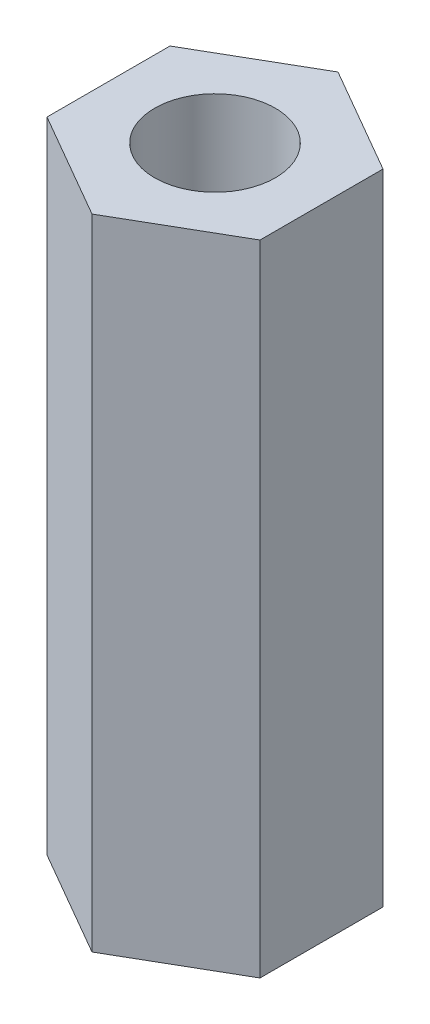
ISO-10303-21;
HEADER;
FILE_DESCRIPTION(('STEP AP214'),'2;1');
FILE_NAME('part.step','',(''),(''),'','','');
FILE_SCHEMA(('AUTOMOTIVE_DESIGN { 1 0 10303 214 1 1 1 1 }'));
ENDSEC;
DATA;
#1=APPLICATION_CONTEXT('core data for automotive mechanical design processes');
#2=APPLICATION_PROTOCOL_DEFINITION('international standard','automotive_design',2000,#1);
#3=PRODUCT_CONTEXT('',#1,'mechanical');
#4=PRODUCT('Part','Part','',(#3));
#5=PRODUCT_RELATED_PRODUCT_CATEGORY('part','',(#4));
#6=PRODUCT_DEFINITION_FORMATION('','',#4);
#7=PRODUCT_DEFINITION_CONTEXT('part definition',#1,'design');
#8=PRODUCT_DEFINITION('design','',#6,#7);
#9=PRODUCT_DEFINITION_SHAPE('','',#8);
#10=(LENGTH_UNIT() NAMED_UNIT(*) SI_UNIT(.MILLI.,.METRE.));
#11=(NAMED_UNIT(*) PLANE_ANGLE_UNIT() SI_UNIT($,.RADIAN.));
#12=(NAMED_UNIT(*) SI_UNIT($,.STERADIAN.) SOLID_ANGLE_UNIT());
#13=UNCERTAINTY_MEASURE_WITH_UNIT(LENGTH_MEASURE(1.E-05),#10,'distance_accuracy_value','');
#14=(GEOMETRIC_REPRESENTATION_CONTEXT(3) GLOBAL_UNCERTAINTY_ASSIGNED_CONTEXT((#13)) GLOBAL_UNIT_ASSIGNED_CONTEXT((#10,
#11,#12)) REPRESENTATION_CONTEXT('',''));
#15=CARTESIAN_POINT('',(0.,0.,0.));
#16=DIRECTION('',(0.,0.,1.));
#17=DIRECTION('',(1.,0.,0.));
#18=AXIS2_PLACEMENT_3D('',#15,#16,#17);
#19=CARTESIAN_POINT('',(0.,9.,0.));
#20=DIRECTION('',(0.,1.,0.));
#21=DIRECTION('',(0.,0.,1.));
#22=AXIS2_PLACEMENT_3D('',#19,#20,#21);
#23=PLANE('',#22);
#24=DIRECTION('',(0.866025403784439,0.,0.5));
#25=VECTOR('',#24,1.);
#26=CARTESIAN_POINT('',(-1.5,9.,0.86602540378444));
#27=LINE('',#26,#25);
#28=CARTESIAN_POINT('',(-1.5,9.,0.86602540378444));
#29=VERTEX_POINT('',#28);
#30=CARTESIAN_POINT('',(0.,9.,1.73205080756888));
#31=VERTEX_POINT('',#30);
#32=EDGE_CURVE('E128',#29,#31,#27,.T.);
#33=ORIENTED_EDGE('',*,*,#32,.T.);
#34=DIRECTION('',(0.866025403784438,0.,-0.5));
#35=VECTOR('',#34,1.);
#36=CARTESIAN_POINT('',(0.,9.,1.73205080756888));
#37=LINE('',#36,#35);
#38=CARTESIAN_POINT('',(1.5,9.,0.866025403784438));
#39=VERTEX_POINT('',#38);
#40=EDGE_CURVE('E86',#31,#39,#37,.T.);
#41=ORIENTED_EDGE('',*,*,#40,.T.);
#42=DIRECTION('',(0.,0.,-1.));
#43=VECTOR('',#42,1.);
#44=CARTESIAN_POINT('',(1.5,9.,0.866025403784438));
#45=LINE('',#44,#43);
#46=CARTESIAN_POINT('',(1.5,9.,-0.866025403784439));
#47=VERTEX_POINT('',#46);
#48=EDGE_CURVE('E99',#39,#47,#45,.T.);
#49=ORIENTED_EDGE('',*,*,#48,.T.);
#50=DIRECTION('',(-0.866025403784439,0.,-0.5));
#51=VECTOR('',#50,1.);
#52=CARTESIAN_POINT('',(1.5,9.,-0.866025403784439));
#53=LINE('',#52,#51);
#54=CARTESIAN_POINT('',(0.,9.,-1.73205080756888));
#55=VERTEX_POINT('',#54);
#56=EDGE_CURVE('E93',#47,#55,#53,.T.);
#57=ORIENTED_EDGE('',*,*,#56,.T.);
#58=DIRECTION('',(-0.866025403784438,0.,0.5));
#59=VECTOR('',#58,1.);
#60=CARTESIAN_POINT('',(0.,9.,-1.73205080756888));
#61=LINE('',#60,#59);
#62=CARTESIAN_POINT('',(-1.5,9.,-0.866025403784438));
#63=VERTEX_POINT('',#62);
#64=EDGE_CURVE('E97',#55,#63,#61,.T.);
#65=ORIENTED_EDGE('',*,*,#64,.T.);
#66=DIRECTION('',(0.,0.,1.));
#67=VECTOR('',#66,1.);
#68=CARTESIAN_POINT('',(-1.5,9.,-0.866025403784438));
#69=LINE('',#68,#67);
#70=EDGE_CURVE('E49',#63,#29,#69,.T.);
#71=ORIENTED_EDGE('',*,*,#70,.T.);
#72=EDGE_LOOP('',(#33,#41,#49,#57,#65,#71));
#73=FACE_BOUND('',#72,.T.);
#74=CARTESIAN_POINT('',(0.,9.,0.));
#75=DIRECTION('',(0.,1.,0.));
#76=DIRECTION('',(0.,0.,1.));
#77=AXIS2_PLACEMENT_3D('',#74,#75,#76);
#78=CIRCLE('',#77,0.85);
#79=CARTESIAN_POINT('',(0.,9.,0.85));
#80=VERTEX_POINT('',#79);
#81=EDGE_CURVE('E121',#80,#80,#78,.T.);
#82=ORIENTED_EDGE('',*,*,#81,.F.);
#83=EDGE_LOOP('',(#82));
#84=FACE_BOUND('',#83,.T.);
#85=ADVANCED_FACE('F32',(#73,#84),#23,.T.);
#86=CARTESIAN_POINT('',(0.,0.,0.));
#87=DIRECTION('',(0.,1.,0.));
#88=DIRECTION('',(0.,0.,1.));
#89=AXIS2_PLACEMENT_3D('',#86,#87,#88);
#90=PLANE('',#89);
#91=DIRECTION('',(0.866025403784439,0.,0.5));
#92=VECTOR('',#91,1.);
#93=CARTESIAN_POINT('',(-1.5,0.,0.86602540378444));
#94=LINE('',#93,#92);
#95=CARTESIAN_POINT('',(-1.5,0.,0.86602540378444));
#96=VERTEX_POINT('',#95);
#97=CARTESIAN_POINT('',(0.,0.,1.73205080756888));
#98=VERTEX_POINT('',#97);
#99=EDGE_CURVE('E117',#96,#98,#94,.T.);
#100=ORIENTED_EDGE('',*,*,#99,.F.);
#101=DIRECTION('',(0.,0.,1.));
#102=VECTOR('',#101,1.);
#103=CARTESIAN_POINT('',(-1.5,0.,-0.866025403784438));
#104=LINE('',#103,#102);
#105=CARTESIAN_POINT('',(-1.5,0.,-0.866025403784438));
#106=VERTEX_POINT('',#105);
#107=EDGE_CURVE('E78',#106,#96,#104,.T.);
#108=ORIENTED_EDGE('',*,*,#107,.F.);
#109=DIRECTION('',(-0.866025403784438,0.,0.5));
#110=VECTOR('',#109,1.);
#111=CARTESIAN_POINT('',(0.,0.,-1.73205080756888));
#112=LINE('',#111,#110);
#113=CARTESIAN_POINT('',(0.,0.,-1.73205080756888));
#114=VERTEX_POINT('',#113);
#115=EDGE_CURVE('E72',#114,#106,#112,.T.);
#116=ORIENTED_EDGE('',*,*,#115,.F.);
#117=DIRECTION('',(-0.866025403784439,0.,-0.5));
#118=VECTOR('',#117,1.);
#119=CARTESIAN_POINT('',(1.5,0.,-0.866025403784439));
#120=LINE('',#119,#118);
#121=CARTESIAN_POINT('',(1.5,0.,-0.866025403784439));
#122=VERTEX_POINT('',#121);
#123=EDGE_CURVE('E107',#122,#114,#120,.T.);
#124=ORIENTED_EDGE('',*,*,#123,.F.);
#125=DIRECTION('',(0.,0.,-1.));
#126=VECTOR('',#125,1.);
#127=CARTESIAN_POINT('',(1.5,0.,0.866025403784438));
#128=LINE('',#127,#126);
#129=CARTESIAN_POINT('',(1.5,0.,0.866025403784438));
#130=VERTEX_POINT('',#129);
#131=EDGE_CURVE('E123',#130,#122,#128,.T.);
#132=ORIENTED_EDGE('',*,*,#131,.F.);
#133=DIRECTION('',(0.866025403784438,0.,-0.5));
#134=VECTOR('',#133,1.);
#135=CARTESIAN_POINT('',(0.,0.,1.73205080756888));
#136=LINE('',#135,#134);
#137=EDGE_CURVE('E120',#98,#130,#136,.T.);
#138=ORIENTED_EDGE('',*,*,#137,.F.);
#139=EDGE_LOOP('',(#100,#108,#116,#124,#132,#138));
#140=FACE_BOUND('',#139,.T.);
#141=CARTESIAN_POINT('',(0.,0.,0.));
#142=DIRECTION('',(0.,1.,0.));
#143=DIRECTION('',(0.,0.,1.));
#144=AXIS2_PLACEMENT_3D('',#141,#142,#143);
#145=CIRCLE('',#144,0.85);
#146=CARTESIAN_POINT('',(0.,0.,0.85));
#147=VERTEX_POINT('',#146);
#148=EDGE_CURVE('E221',#147,#147,#145,.T.);
#149=ORIENTED_EDGE('',*,*,#148,.T.);
#150=EDGE_LOOP('',(#149));
#151=FACE_BOUND('',#150,.T.);
#152=ADVANCED_FACE('F137',(#140,#151),#90,.F.);
#153=CARTESIAN_POINT('',(-1.5,9.,0.86602540378444));
#154=DIRECTION('',(0.5,0.,-0.866025403784439));
#155=DIRECTION('',(-0.866025403784439,0.,-0.5));
#156=AXIS2_PLACEMENT_3D('',#153,#154,#155);
#157=PLANE('',#156);
#158=ORIENTED_EDGE('',*,*,#99,.T.);
#159=DIRECTION('',(0.,-1.,0.));
#160=VECTOR('',#159,1.);
#161=CARTESIAN_POINT('',(0.,9.,1.73205080756888));
#162=LINE('',#161,#160);
#163=EDGE_CURVE('E11',#31,#98,#162,.T.);
#164=ORIENTED_EDGE('',*,*,#163,.F.);
#165=ORIENTED_EDGE('',*,*,#32,.F.);
#166=DIRECTION('',(0.,-1.,0.));
#167=VECTOR('',#166,1.);
#168=CARTESIAN_POINT('',(-1.5,9.,0.86602540378444));
#169=LINE('',#168,#167);
#170=EDGE_CURVE('E113',#29,#96,#169,.T.);
#171=ORIENTED_EDGE('',*,*,#170,.T.);
#172=EDGE_LOOP('',(#158,#164,#165,#171));
#173=FACE_BOUND('',#172,.T.);
#174=ADVANCED_FACE('F34',(#173),#157,.F.);
#175=CARTESIAN_POINT('',(0.,9.,1.73205080756888));
#176=DIRECTION('',(-0.5,0.,-0.866025403784438));
#177=DIRECTION('',(-0.866025403784438,0.,0.500000000000001));
#178=AXIS2_PLACEMENT_3D('',#175,#176,#177);
#179=PLANE('',#178);
#180=ORIENTED_EDGE('',*,*,#137,.T.);
#181=DIRECTION('',(0.,-1.,0.));
#182=VECTOR('',#181,1.);
#183=CARTESIAN_POINT('',(1.5,9.,0.866025403784438));
#184=LINE('',#183,#182);
#185=EDGE_CURVE('E41',#39,#130,#184,.T.);
#186=ORIENTED_EDGE('',*,*,#185,.F.);
#187=ORIENTED_EDGE('',*,*,#40,.F.);
#188=ORIENTED_EDGE('',*,*,#163,.T.);
#189=EDGE_LOOP('',(#180,#186,#187,#188));
#190=FACE_BOUND('',#189,.T.);
#191=ADVANCED_FACE('F162',(#190),#179,.F.);
#192=CARTESIAN_POINT('',(1.5,9.,0.866025403784438));
#193=DIRECTION('',(-1.,0.,0.));
#194=DIRECTION('',(0.,0.,1.));
#195=AXIS2_PLACEMENT_3D('',#192,#193,#194);
#196=PLANE('',#195);
#197=ORIENTED_EDGE('',*,*,#131,.T.);
#198=DIRECTION('',(0.,-1.,0.));
#199=VECTOR('',#198,1.);
#200=CARTESIAN_POINT('',(1.5,9.,-0.866025403784439));
#201=LINE('',#200,#199);
#202=EDGE_CURVE('E108',#47,#122,#201,.T.);
#203=ORIENTED_EDGE('',*,*,#202,.F.);
#204=ORIENTED_EDGE('',*,*,#48,.F.);
#205=ORIENTED_EDGE('',*,*,#185,.T.);
#206=EDGE_LOOP('',(#197,#203,#204,#205));
#207=FACE_BOUND('',#206,.T.);
#208=ADVANCED_FACE('F134',(#207),#196,.F.);
#209=CARTESIAN_POINT('',(1.5,9.,-0.866025403784439));
#210=DIRECTION('',(-0.5,0.,0.866025403784439));
#211=DIRECTION('',(0.866025403784439,0.,0.5));
#212=AXIS2_PLACEMENT_3D('',#209,#210,#211);
#213=PLANE('',#212);
#214=ORIENTED_EDGE('',*,*,#123,.T.);
#215=DIRECTION('',(0.,-1.,0.));
#216=VECTOR('',#215,1.);
#217=CARTESIAN_POINT('',(0.,9.,-1.73205080756888));
#218=LINE('',#217,#216);
#219=EDGE_CURVE('E104',#55,#114,#218,.T.);
#220=ORIENTED_EDGE('',*,*,#219,.F.);
#221=ORIENTED_EDGE('',*,*,#56,.F.);
#222=ORIENTED_EDGE('',*,*,#202,.T.);
#223=EDGE_LOOP('',(#214,#220,#221,#222));
#224=FACE_BOUND('',#223,.T.);
#225=ADVANCED_FACE('F105',(#224),#213,.F.);
#226=CARTESIAN_POINT('',(0.,9.,-1.73205080756888));
#227=DIRECTION('',(0.5,0.,0.866025403784438));
#228=DIRECTION('',(0.866025403784439,0.,-0.5));
#229=AXIS2_PLACEMENT_3D('',#226,#227,#228);
#230=PLANE('',#229);
#231=ORIENTED_EDGE('',*,*,#115,.T.);
#232=DIRECTION('',(0.,-1.,0.));
#233=VECTOR('',#232,1.);
#234=CARTESIAN_POINT('',(-1.5,9.,-0.866025403784438));
#235=LINE('',#234,#233);
#236=EDGE_CURVE('E109',#63,#106,#235,.T.);
#237=ORIENTED_EDGE('',*,*,#236,.F.);
#238=ORIENTED_EDGE('',*,*,#64,.F.);
#239=ORIENTED_EDGE('',*,*,#219,.T.);
#240=EDGE_LOOP('',(#231,#237,#238,#239));
#241=FACE_BOUND('',#240,.T.);
#242=ADVANCED_FACE('F111',(#241),#230,.F.);
#243=CARTESIAN_POINT('',(-1.5,9.,-0.866025403784438));
#244=DIRECTION('',(1.,0.,0.));
#245=DIRECTION('',(0.,0.,-1.));
#246=AXIS2_PLACEMENT_3D('',#243,#244,#245);
#247=PLANE('',#246);
#248=ORIENTED_EDGE('',*,*,#107,.T.);
#249=ORIENTED_EDGE('',*,*,#170,.F.);
#250=ORIENTED_EDGE('',*,*,#70,.F.);
#251=ORIENTED_EDGE('',*,*,#236,.T.);
#252=EDGE_LOOP('',(#248,#249,#250,#251));
#253=FACE_BOUND('',#252,.T.);
#254=ADVANCED_FACE('F142',(#253),#247,.F.);
#255=CARTESIAN_POINT('',(0.,9.,0.));
#256=DIRECTION('',(0.,-1.,0.));
#257=DIRECTION('',(0.,0.,-1.));
#258=AXIS2_PLACEMENT_3D('',#255,#256,#257);
#259=CYLINDRICAL_SURFACE('',#258,0.85);
#260=ORIENTED_EDGE('',*,*,#81,.T.);
#261=EDGE_LOOP('',(#260));
#262=FACE_BOUND('',#261,.T.);
#263=ORIENTED_EDGE('',*,*,#148,.F.);
#264=EDGE_LOOP('',(#263));
#265=FACE_BOUND('',#264,.T.);
#266=ADVANCED_FACE('F144',(#262,#265),#259,.F.);
#267=CLOSED_SHELL('',(#85,#152,#174,#191,#208,#225,#242,#254,#266));
#268=MANIFOLD_SOLID_BREP('B2',#267);
#269=ADVANCED_BREP_SHAPE_REPRESENTATION('',(#18,#268),#14);
#270=SHAPE_DEFINITION_REPRESENTATION(#9,#269);
ENDSEC;
END-ISO-10303-21;
